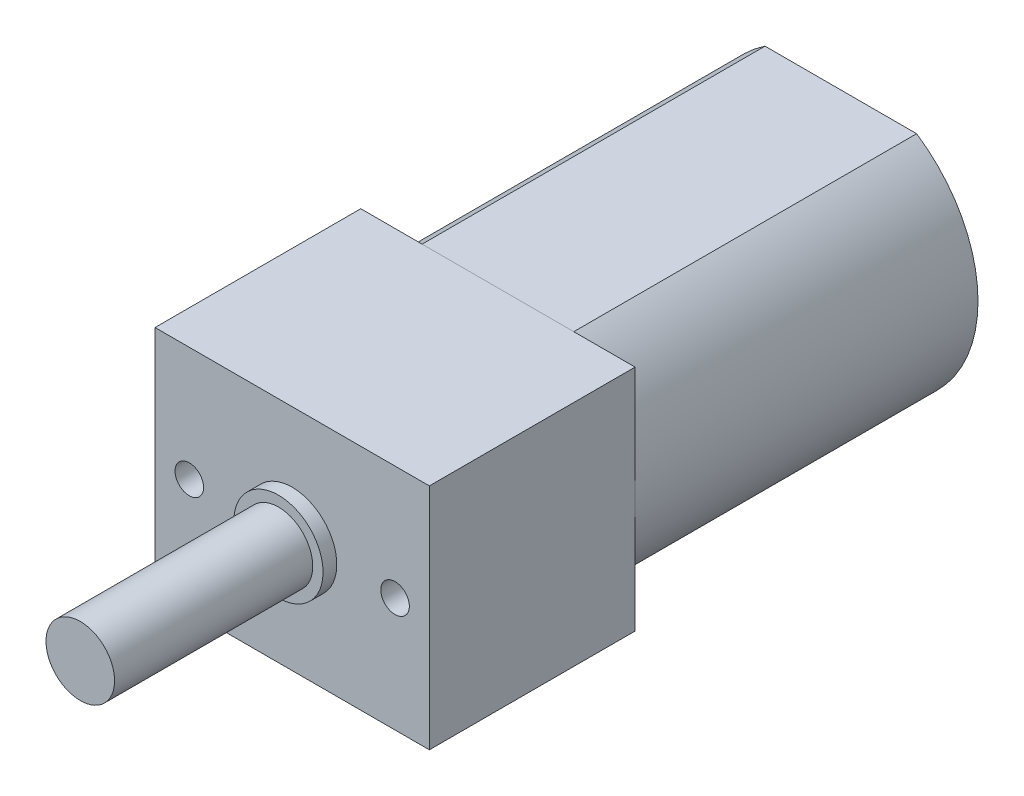
ISO-10303-21;
HEADER;
FILE_DESCRIPTION(('STEP AP214'),'2;1');
FILE_NAME('part.step','',(''),(''),'','','');
FILE_SCHEMA(('AUTOMOTIVE_DESIGN { 1 0 10303 214 1 1 1 1 }'));
ENDSEC;
DATA;
#1=APPLICATION_CONTEXT('core data for automotive mechanical design processes');
#2=APPLICATION_PROTOCOL_DEFINITION('international standard','automotive_design',2000,#1);
#3=PRODUCT_CONTEXT('',#1,'mechanical');
#4=PRODUCT('Part','Part','',(#3));
#5=PRODUCT_RELATED_PRODUCT_CATEGORY('part','',(#4));
#6=PRODUCT_DEFINITION_FORMATION('','',#4);
#7=PRODUCT_DEFINITION_CONTEXT('part definition',#1,'design');
#8=PRODUCT_DEFINITION('design','',#6,#7);
#9=PRODUCT_DEFINITION_SHAPE('','',#8);
#10=(LENGTH_UNIT() NAMED_UNIT(*) SI_UNIT(.MILLI.,.METRE.));
#11=(NAMED_UNIT(*) PLANE_ANGLE_UNIT() SI_UNIT($,.RADIAN.));
#12=(NAMED_UNIT(*) SI_UNIT($,.STERADIAN.) SOLID_ANGLE_UNIT());
#13=UNCERTAINTY_MEASURE_WITH_UNIT(LENGTH_MEASURE(1.E-05),#10,'distance_accuracy_value','');
#14=(GEOMETRIC_REPRESENTATION_CONTEXT(3) GLOBAL_UNCERTAINTY_ASSIGNED_CONTEXT((#13)) GLOBAL_UNIT_ASSIGNED_CONTEXT((#10,
#11,#12)) REPRESENTATION_CONTEXT('',''));
#15=CARTESIAN_POINT('',(0.,0.,0.));
#16=DIRECTION('',(0.,0.,1.));
#17=DIRECTION('',(1.,0.,0.));
#18=AXIS2_PLACEMENT_3D('',#15,#16,#17);
#19=CARTESIAN_POINT('',(0.,0.,-17.));
#20=DIRECTION('',(0.,0.,1.));
#21=DIRECTION('',(1.,0.,0.));
#22=AXIS2_PLACEMENT_3D('',#19,#20,#21);
#23=CYLINDRICAL_SURFACE('',#22,2.5);
#24=CARTESIAN_POINT('',(0.,0.,-17.));
#25=DIRECTION('',(0.,0.,-1.));
#26=DIRECTION('',(-1.,0.,0.));
#27=AXIS2_PLACEMENT_3D('',#24,#25,#26);
#28=CIRCLE('',#27,2.5);
#29=CARTESIAN_POINT('',(-2.5,0.,-17.));
#30=VERTEX_POINT('',#29);
#31=EDGE_CURVE('E11',#30,#30,#28,.T.);
#32=ORIENTED_EDGE('',*,*,#31,.F.);
#33=EDGE_LOOP('',(#32));
#34=FACE_BOUND('',#33,.T.);
#35=CARTESIAN_POINT('',(0.,0.,-15.));
#36=DIRECTION('',(0.,0.,-1.));
#37=DIRECTION('',(-1.,0.,0.));
#38=AXIS2_PLACEMENT_3D('',#35,#36,#37);
#39=CIRCLE('',#38,2.5);
#40=CARTESIAN_POINT('',(-2.5,0.,-15.));
#41=VERTEX_POINT('',#40);
#42=EDGE_CURVE('E52',#41,#41,#39,.T.);
#43=ORIENTED_EDGE('',*,*,#42,.T.);
#44=EDGE_LOOP('',(#43));
#45=FACE_BOUND('',#44,.T.);
#46=ADVANCED_FACE('F49',(#34,#45),#23,.T.);
#47=CARTESIAN_POINT('',(0.,0.,-17.));
#48=DIRECTION('',(0.,0.,-1.));
#49=DIRECTION('',(-1.,0.,0.));
#50=AXIS2_PLACEMENT_3D('',#47,#48,#49);
#51=PLANE('',#50);
#52=ORIENTED_EDGE('',*,*,#31,.T.);
#53=EDGE_LOOP('',(#52));
#54=FACE_BOUND('',#53,.T.);
#55=ADVANCED_FACE('F64',(#54),#51,.T.);
#56=CARTESIAN_POINT('',(0.,0.,-15.));
#57=DIRECTION('',(0.,0.,-1.));
#58=DIRECTION('',(-1.,0.,0.));
#59=AXIS2_PLACEMENT_3D('',#56,#57,#58);
#60=PLANE('',#59);
#61=ORIENTED_EDGE('',*,*,#42,.F.);
#62=EDGE_LOOP('',(#61));
#63=FACE_BOUND('',#62,.T.);
#64=ADVANCED_FACE('F62',(#63),#60,.F.);
#65=CLOSED_SHELL('',(#46,#55,#64));
#66=MANIFOLD_SOLID_BREP('B2',#65);
#67=CARTESIAN_POINT('',(0.,0.,-15.));
#68=DIRECTION('',(0.,0.,1.));
#69=DIRECTION('',(1.,0.,0.));
#70=AXIS2_PLACEMENT_3D('',#67,#68,#69);
#71=CYLINDRICAL_SURFACE('',#70,6.);
#72=CARTESIAN_POINT('',(0.,0.,0.));
#73=DIRECTION('',(0.,0.,-1.));
#74=DIRECTION('',(-1.,0.,0.));
#75=AXIS2_PLACEMENT_3D('',#72,#73,#74);
#76=CIRCLE('',#75,6.);
#77=CARTESIAN_POINT('',(3.31662479035539,5.,0.));
#78=VERTEX_POINT('',#77);
#79=CARTESIAN_POINT('',(3.31662479035539,-5.,0.));
#80=VERTEX_POINT('',#79);
#81=EDGE_CURVE('E161',#78,#80,#76,.T.);
#82=ORIENTED_EDGE('',*,*,#81,.T.);
#83=DIRECTION('',(0.,0.,1.));
#84=VECTOR('',#83,1.);
#85=CARTESIAN_POINT('',(3.31662479035539,-5.,-15.));
#86=LINE('',#85,#84);
#87=CARTESIAN_POINT('',(3.31662479035539,-5.,-15.));
#88=VERTEX_POINT('',#87);
#89=EDGE_CURVE('E47',#88,#80,#86,.T.);
#90=ORIENTED_EDGE('',*,*,#89,.F.);
#91=CARTESIAN_POINT('',(0.,0.,-15.));
#92=DIRECTION('',(0.,0.,-1.));
#93=DIRECTION('',(-1.,0.,0.));
#94=AXIS2_PLACEMENT_3D('',#91,#92,#93);
#95=CIRCLE('',#94,6.);
#96=CARTESIAN_POINT('',(3.31662479035539,5.,-15.));
#97=VERTEX_POINT('',#96);
#98=EDGE_CURVE('E149',#97,#88,#95,.T.);
#99=ORIENTED_EDGE('',*,*,#98,.F.);
#100=DIRECTION('',(0.,0.,1.));
#101=VECTOR('',#100,1.);
#102=CARTESIAN_POINT('',(3.31662479035539,5.,-15.));
#103=LINE('',#102,#101);
#104=EDGE_CURVE('E157',#97,#78,#103,.T.);
#105=ORIENTED_EDGE('',*,*,#104,.T.);
#106=EDGE_LOOP('',(#82,#90,#99,#105));
#107=FACE_BOUND('',#106,.T.);
#108=ADVANCED_FACE('F98',(#107),#71,.T.);
#109=CARTESIAN_POINT('',(3.31662479035539,-5.,-15.));
#110=DIRECTION('',(0.,1.,0.));
#111=DIRECTION('',(0.,0.,1.));
#112=AXIS2_PLACEMENT_3D('',#109,#110,#111);
#113=PLANE('',#112);
#114=DIRECTION('',(-1.,0.,0.));
#115=VECTOR('',#114,1.);
#116=CARTESIAN_POINT('',(3.31662479035539,-5.,0.));
#117=LINE('',#116,#115);
#118=CARTESIAN_POINT('',(-3.31662479035539,-5.,0.));
#119=VERTEX_POINT('',#118);
#120=EDGE_CURVE('E153',#80,#119,#117,.T.);
#121=ORIENTED_EDGE('',*,*,#120,.T.);
#122=DIRECTION('',(0.,0.,1.));
#123=VECTOR('',#122,1.);
#124=CARTESIAN_POINT('',(-3.31662479035539,-5.,-15.));
#125=LINE('',#124,#123);
#126=CARTESIAN_POINT('',(-3.31662479035539,-5.,-15.));
#127=VERTEX_POINT('',#126);
#128=EDGE_CURVE('E106',#127,#119,#125,.T.);
#129=ORIENTED_EDGE('',*,*,#128,.F.);
#130=DIRECTION('',(-1.,0.,0.));
#131=VECTOR('',#130,1.);
#132=CARTESIAN_POINT('',(3.31662479035539,-5.,-15.));
#133=LINE('',#132,#131);
#134=EDGE_CURVE('E144',#88,#127,#133,.T.);
#135=ORIENTED_EDGE('',*,*,#134,.F.);
#136=ORIENTED_EDGE('',*,*,#89,.T.);
#137=EDGE_LOOP('',(#121,#129,#135,#136));
#138=FACE_BOUND('',#137,.T.);
#139=ADVANCED_FACE('F152',(#138),#113,.F.);
#140=CARTESIAN_POINT('',(0.,0.,-15.));
#141=DIRECTION('',(0.,0.,1.));
#142=DIRECTION('',(1.,0.,0.));
#143=AXIS2_PLACEMENT_3D('',#140,#141,#142);
#144=CYLINDRICAL_SURFACE('',#143,6.);
#145=CARTESIAN_POINT('',(0.,0.,0.));
#146=DIRECTION('',(0.,0.,-1.));
#147=DIRECTION('',(-1.,0.,0.));
#148=AXIS2_PLACEMENT_3D('',#145,#146,#147);
#149=CIRCLE('',#148,6.);
#150=CARTESIAN_POINT('',(-3.31662479035539,5.,0.));
#151=VERTEX_POINT('',#150);
#152=EDGE_CURVE('E131',#119,#151,#149,.T.);
#153=ORIENTED_EDGE('',*,*,#152,.T.);
#154=DIRECTION('',(0.,0.,1.));
#155=VECTOR('',#154,1.);
#156=CARTESIAN_POINT('',(-3.31662479035539,5.,-15.));
#157=LINE('',#156,#155);
#158=CARTESIAN_POINT('',(-3.31662479035539,5.,-15.));
#159=VERTEX_POINT('',#158);
#160=EDGE_CURVE('E154',#159,#151,#157,.T.);
#161=ORIENTED_EDGE('',*,*,#160,.F.);
#162=CARTESIAN_POINT('',(0.,0.,-15.));
#163=DIRECTION('',(0.,0.,-1.));
#164=DIRECTION('',(-1.,0.,0.));
#165=AXIS2_PLACEMENT_3D('',#162,#163,#164);
#166=CIRCLE('',#165,6.);
#167=EDGE_CURVE('E147',#127,#159,#166,.T.);
#168=ORIENTED_EDGE('',*,*,#167,.F.);
#169=ORIENTED_EDGE('',*,*,#128,.T.);
#170=EDGE_LOOP('',(#153,#161,#168,#169));
#171=FACE_BOUND('',#170,.T.);
#172=ADVANCED_FACE('F155',(#171),#144,.T.);
#173=CARTESIAN_POINT('',(3.31662479035539,5.,-15.));
#174=DIRECTION('',(0.,-1.,0.));
#175=DIRECTION('',(0.,0.,-1.));
#176=AXIS2_PLACEMENT_3D('',#173,#174,#175);
#177=PLANE('',#176);
#178=DIRECTION('',(1.,0.,0.));
#179=VECTOR('',#178,1.);
#180=CARTESIAN_POINT('',(3.31662479035539,5.,0.));
#181=LINE('',#180,#179);
#182=EDGE_CURVE('E137',#151,#78,#181,.T.);
#183=ORIENTED_EDGE('',*,*,#182,.T.);
#184=ORIENTED_EDGE('',*,*,#104,.F.);
#185=DIRECTION('',(1.,0.,0.));
#186=VECTOR('',#185,1.);
#187=CARTESIAN_POINT('',(3.31662479035539,5.,-15.));
#188=LINE('',#187,#186);
#189=EDGE_CURVE('E114',#159,#97,#188,.T.);
#190=ORIENTED_EDGE('',*,*,#189,.F.);
#191=ORIENTED_EDGE('',*,*,#160,.T.);
#192=EDGE_LOOP('',(#183,#184,#190,#191));
#193=FACE_BOUND('',#192,.T.);
#194=ADVANCED_FACE('F168',(#193),#177,.F.);
#195=CARTESIAN_POINT('',(0.,0.,-15.));
#196=DIRECTION('',(0.,0.,-1.));
#197=DIRECTION('',(-1.,0.,0.));
#198=AXIS2_PLACEMENT_3D('',#195,#196,#197);
#199=PLANE('',#198);
#200=ORIENTED_EDGE('',*,*,#98,.T.);
#201=ORIENTED_EDGE('',*,*,#134,.T.);
#202=ORIENTED_EDGE('',*,*,#167,.T.);
#203=ORIENTED_EDGE('',*,*,#189,.T.);
#204=EDGE_LOOP('',(#200,#201,#202,#203));
#205=FACE_BOUND('',#204,.T.);
#206=ADVANCED_FACE('F145',(#205),#199,.T.);
#207=CARTESIAN_POINT('',(0.,0.,0.));
#208=DIRECTION('',(0.,0.,-1.));
#209=DIRECTION('',(-1.,0.,0.));
#210=AXIS2_PLACEMENT_3D('',#207,#208,#209);
#211=PLANE('',#210);
#212=ORIENTED_EDGE('',*,*,#81,.F.);
#213=ORIENTED_EDGE('',*,*,#182,.F.);
#214=ORIENTED_EDGE('',*,*,#152,.F.);
#215=ORIENTED_EDGE('',*,*,#120,.F.);
#216=EDGE_LOOP('',(#212,#213,#214,#215));
#217=FACE_BOUND('',#216,.T.);
#218=ADVANCED_FACE('F171',(#217),#211,.F.);
#219=CLOSED_SHELL('',(#108,#139,#172,#194,#206,#218));
#220=MANIFOLD_SOLID_BREP('B6',#219);
#221=CARTESIAN_POINT('',(6.,-5.,9.));
#222=DIRECTION('',(-1.,0.,0.));
#223=DIRECTION('',(0.,0.,1.));
#224=AXIS2_PLACEMENT_3D('',#221,#222,#223);
#225=PLANE('',#224);
#226=DIRECTION('',(0.,1.,0.));
#227=VECTOR('',#226,1.);
#228=CARTESIAN_POINT('',(6.,-5.,0.));
#229=LINE('',#228,#227);
#230=CARTESIAN_POINT('',(6.,-5.,0.));
#231=VERTEX_POINT('',#230);
#232=CARTESIAN_POINT('',(6.,5.,0.));
#233=VERTEX_POINT('',#232);
#234=EDGE_CURVE('E310',#231,#233,#229,.T.);
#235=ORIENTED_EDGE('',*,*,#234,.T.);
#236=DIRECTION('',(0.,0.,-1.));
#237=VECTOR('',#236,1.);
#238=CARTESIAN_POINT('',(6.,5.,9.));
#239=LINE('',#238,#237);
#240=CARTESIAN_POINT('',(6.,5.,9.));
#241=VERTEX_POINT('',#240);
#242=EDGE_CURVE('E96',#241,#233,#239,.T.);
#243=ORIENTED_EDGE('',*,*,#242,.F.);
#244=DIRECTION('',(0.,1.,0.));
#245=VECTOR('',#244,1.);
#246=CARTESIAN_POINT('',(6.,-5.,9.));
#247=LINE('',#246,#245);
#248=CARTESIAN_POINT('',(6.,-5.,9.));
#249=VERTEX_POINT('',#248);
#250=EDGE_CURVE('E311',#249,#241,#247,.T.);
#251=ORIENTED_EDGE('',*,*,#250,.F.);
#252=DIRECTION('',(0.,0.,-1.));
#253=VECTOR('',#252,1.);
#254=CARTESIAN_POINT('',(6.,-5.,9.));
#255=LINE('',#254,#253);
#256=EDGE_CURVE('E317',#249,#231,#255,.T.);
#257=ORIENTED_EDGE('',*,*,#256,.T.);
#258=EDGE_LOOP('',(#235,#243,#251,#257));
#259=FACE_BOUND('',#258,.T.);
#260=ADVANCED_FACE('F223',(#259),#225,.F.);
#261=CARTESIAN_POINT('',(-6.,5.,9.));
#262=DIRECTION('',(0.,-1.,0.));
#263=DIRECTION('',(0.,0.,-1.));
#264=AXIS2_PLACEMENT_3D('',#261,#262,#263);
#265=PLANE('',#264);
#266=DIRECTION('',(-1.,0.,0.));
#267=VECTOR('',#266,1.);
#268=CARTESIAN_POINT('',(-6.,5.,0.));
#269=LINE('',#268,#267);
#270=CARTESIAN_POINT('',(-6.,5.,0.));
#271=VERTEX_POINT('',#270);
#272=EDGE_CURVE('E320',#233,#271,#269,.T.);
#273=ORIENTED_EDGE('',*,*,#272,.T.);
#274=DIRECTION('',(0.,0.,-1.));
#275=VECTOR('',#274,1.);
#276=CARTESIAN_POINT('',(-6.,5.,9.));
#277=LINE('',#276,#275);
#278=CARTESIAN_POINT('',(-6.,5.,9.));
#279=VERTEX_POINT('',#278);
#280=EDGE_CURVE('E231',#279,#271,#277,.T.);
#281=ORIENTED_EDGE('',*,*,#280,.F.);
#282=DIRECTION('',(-1.,0.,0.));
#283=VECTOR('',#282,1.);
#284=CARTESIAN_POINT('',(-6.,5.,9.));
#285=LINE('',#284,#283);
#286=EDGE_CURVE('E270',#241,#279,#285,.T.);
#287=ORIENTED_EDGE('',*,*,#286,.F.);
#288=ORIENTED_EDGE('',*,*,#242,.T.);
#289=EDGE_LOOP('',(#273,#281,#287,#288));
#290=FACE_BOUND('',#289,.T.);
#291=ADVANCED_FACE('F344',(#290),#265,.F.);
#292=CARTESIAN_POINT('',(-6.,-5.,9.));
#293=DIRECTION('',(1.,0.,0.));
#294=DIRECTION('',(0.,0.,-1.));
#295=AXIS2_PLACEMENT_3D('',#292,#293,#294);
#296=PLANE('',#295);
#297=DIRECTION('',(0.,-1.,0.));
#298=VECTOR('',#297,1.);
#299=CARTESIAN_POINT('',(-6.,-5.,0.));
#300=LINE('',#299,#298);
#301=CARTESIAN_POINT('',(-6.,-5.,0.));
#302=VERTEX_POINT('',#301);
#303=EDGE_CURVE('E257',#271,#302,#300,.T.);
#304=ORIENTED_EDGE('',*,*,#303,.T.);
#305=DIRECTION('',(0.,0.,-1.));
#306=VECTOR('',#305,1.);
#307=CARTESIAN_POINT('',(-6.,-5.,9.));
#308=LINE('',#307,#306);
#309=CARTESIAN_POINT('',(-6.,-5.,9.));
#310=VERTEX_POINT('',#309);
#311=EDGE_CURVE('E325',#310,#302,#308,.T.);
#312=ORIENTED_EDGE('',*,*,#311,.F.);
#313=DIRECTION('',(0.,-1.,0.));
#314=VECTOR('',#313,1.);
#315=CARTESIAN_POINT('',(-6.,-5.,9.));
#316=LINE('',#315,#314);
#317=EDGE_CURVE('E314',#279,#310,#316,.T.);
#318=ORIENTED_EDGE('',*,*,#317,.F.);
#319=ORIENTED_EDGE('',*,*,#280,.T.);
#320=EDGE_LOOP('',(#304,#312,#318,#319));
#321=FACE_BOUND('',#320,.T.);
#322=ADVANCED_FACE('F327',(#321),#296,.F.);
#323=CARTESIAN_POINT('',(-6.,-5.,9.));
#324=DIRECTION('',(0.,1.,0.));
#325=DIRECTION('',(0.,0.,1.));
#326=AXIS2_PLACEMENT_3D('',#323,#324,#325);
#327=PLANE('',#326);
#328=DIRECTION('',(1.,0.,0.));
#329=VECTOR('',#328,1.);
#330=CARTESIAN_POINT('',(-6.,-5.,0.));
#331=LINE('',#330,#329);
#332=EDGE_CURVE('E263',#302,#231,#331,.T.);
#333=ORIENTED_EDGE('',*,*,#332,.T.);
#334=ORIENTED_EDGE('',*,*,#256,.F.);
#335=DIRECTION('',(1.,0.,0.));
#336=VECTOR('',#335,1.);
#337=CARTESIAN_POINT('',(-6.,-5.,9.));
#338=LINE('',#337,#336);
#339=EDGE_CURVE('E239',#310,#249,#338,.T.);
#340=ORIENTED_EDGE('',*,*,#339,.F.);
#341=ORIENTED_EDGE('',*,*,#311,.T.);
#342=EDGE_LOOP('',(#333,#334,#340,#341));
#343=FACE_BOUND('',#342,.T.);
#344=ADVANCED_FACE('F334',(#343),#327,.F.);
#345=CARTESIAN_POINT('',(0.,0.,9.));
#346=DIRECTION('',(0.,0.,-1.));
#347=DIRECTION('',(-1.,0.,0.));
#348=AXIS2_PLACEMENT_3D('',#345,#346,#347);
#349=PLANE('',#348);
#350=CARTESIAN_POINT('',(-4.5,0.,9.));
#351=DIRECTION('',(0.,0.,1.));
#352=DIRECTION('',(1.,0.,0.));
#353=AXIS2_PLACEMENT_3D('',#350,#351,#352);
#354=CIRCLE('',#353,0.624999999999999);
#355=CARTESIAN_POINT('',(-3.875,0.,9.));
#356=VERTEX_POINT('',#355);
#357=EDGE_CURVE('E288',#356,#356,#354,.T.);
#358=ORIENTED_EDGE('',*,*,#357,.F.);
#359=EDGE_LOOP('',(#358));
#360=FACE_BOUND('',#359,.T.);
#361=CARTESIAN_POINT('',(4.5,0.,9.));
#362=DIRECTION('',(0.,0.,1.));
#363=DIRECTION('',(1.,0.,0.));
#364=AXIS2_PLACEMENT_3D('',#361,#362,#363);
#365=CIRCLE('',#364,0.624999999999999);
#366=CARTESIAN_POINT('',(5.125,0.,9.));
#367=VERTEX_POINT('',#366);
#368=EDGE_CURVE('E287',#367,#367,#365,.T.);
#369=ORIENTED_EDGE('',*,*,#368,.F.);
#370=EDGE_LOOP('',(#369));
#371=FACE_BOUND('',#370,.T.);
#372=CARTESIAN_POINT('',(0.,0.,9.));
#373=DIRECTION('',(0.,0.,-1.));
#374=DIRECTION('',(0.,1.,0.));
#375=AXIS2_PLACEMENT_3D('',#372,#373,#374);
#376=CIRCLE('',#375,1.95);
#377=CARTESIAN_POINT('',(0.,1.95,9.));
#378=VERTEX_POINT('',#377);
#379=EDGE_CURVE('E307',#378,#378,#376,.T.);
#380=ORIENTED_EDGE('',*,*,#379,.T.);
#381=EDGE_LOOP('',(#380));
#382=FACE_BOUND('',#381,.T.);
#383=ORIENTED_EDGE('',*,*,#250,.T.);
#384=ORIENTED_EDGE('',*,*,#286,.T.);
#385=ORIENTED_EDGE('',*,*,#317,.T.);
#386=ORIENTED_EDGE('',*,*,#339,.T.);
#387=EDGE_LOOP('',(#383,#384,#385,#386));
#388=FACE_BOUND('',#387,.T.);
#389=ADVANCED_FACE('F336',(#360,#371,#382,#388),#349,.F.);
#390=CARTESIAN_POINT('',(0.,0.,0.));
#391=DIRECTION('',(0.,0.,-1.));
#392=DIRECTION('',(-1.,0.,0.));
#393=AXIS2_PLACEMENT_3D('',#390,#391,#392);
#394=PLANE('',#393);
#395=ORIENTED_EDGE('',*,*,#234,.F.);
#396=ORIENTED_EDGE('',*,*,#332,.F.);
#397=ORIENTED_EDGE('',*,*,#303,.F.);
#398=ORIENTED_EDGE('',*,*,#272,.F.);
#399=EDGE_LOOP('',(#395,#396,#397,#398));
#400=FACE_BOUND('',#399,.T.);
#401=ADVANCED_FACE('F330',(#400),#394,.T.);
#402=CARTESIAN_POINT('',(0.,0.,9.));
#403=DIRECTION('',(0.,0.,-1.));
#404=DIRECTION('',(0.,1.,0.));
#405=AXIS2_PLACEMENT_3D('',#402,#403,#404);
#406=CYLINDRICAL_SURFACE('',#405,1.95);
#407=CARTESIAN_POINT('',(0.,0.,9.6));
#408=DIRECTION('',(0.,0.,-1.));
#409=DIRECTION('',(0.,1.,0.));
#410=AXIS2_PLACEMENT_3D('',#407,#408,#409);
#411=CIRCLE('',#410,1.95);
#412=CARTESIAN_POINT('',(0.,1.95,9.6));
#413=VERTEX_POINT('',#412);
#414=EDGE_CURVE('E304',#413,#413,#411,.T.);
#415=ORIENTED_EDGE('',*,*,#414,.T.);
#416=EDGE_LOOP('',(#415));
#417=FACE_BOUND('',#416,.T.);
#418=ORIENTED_EDGE('',*,*,#379,.F.);
#419=EDGE_LOOP('',(#418));
#420=FACE_BOUND('',#419,.T.);
#421=ADVANCED_FACE('F371',(#417,#420),#406,.T.);
#422=CARTESIAN_POINT('',(0.,1.95,9.6));
#423=DIRECTION('',(0.,0.,1.));
#424=DIRECTION('',(0.,-1.,0.));
#425=AXIS2_PLACEMENT_3D('',#422,#423,#424);
#426=PLANE('',#425);
#427=CARTESIAN_POINT('',(0.,0.,9.6));
#428=DIRECTION('',(0.,0.,-1.));
#429=DIRECTION('',(0.,1.,0.));
#430=AXIS2_PLACEMENT_3D('',#427,#428,#429);
#431=CIRCLE('',#430,1.5);
#432=CARTESIAN_POINT('',(0.,1.5,9.6));
#433=VERTEX_POINT('',#432);
#434=EDGE_CURVE('E301',#433,#433,#431,.T.);
#435=ORIENTED_EDGE('',*,*,#434,.T.);
#436=EDGE_LOOP('',(#435));
#437=FACE_BOUND('',#436,.T.);
#438=ORIENTED_EDGE('',*,*,#414,.F.);
#439=EDGE_LOOP('',(#438));
#440=FACE_BOUND('',#439,.T.);
#441=ADVANCED_FACE('F380',(#437,#440),#426,.T.);
#442=CARTESIAN_POINT('',(0.,0.,9.));
#443=DIRECTION('',(0.,0.,-1.));
#444=DIRECTION('',(0.,1.,0.));
#445=AXIS2_PLACEMENT_3D('',#442,#443,#444);
#446=CYLINDRICAL_SURFACE('',#445,1.5);
#447=CARTESIAN_POINT('',(0.,0.,18.27));
#448=DIRECTION('',(0.,0.,-1.));
#449=DIRECTION('',(0.,1.,0.));
#450=AXIS2_PLACEMENT_3D('',#447,#448,#449);
#451=CIRCLE('',#450,1.5);
#452=CARTESIAN_POINT('',(0.,1.5,18.27));
#453=VERTEX_POINT('',#452);
#454=EDGE_CURVE('E298',#453,#453,#451,.T.);
#455=ORIENTED_EDGE('',*,*,#454,.T.);
#456=EDGE_LOOP('',(#455));
#457=FACE_BOUND('',#456,.T.);
#458=ORIENTED_EDGE('',*,*,#434,.F.);
#459=EDGE_LOOP('',(#458));
#460=FACE_BOUND('',#459,.T.);
#461=ADVANCED_FACE('F392',(#457,#460),#446,.T.);
#462=CARTESIAN_POINT('',(0.,1.5,18.27));
#463=DIRECTION('',(0.,0.,1.));
#464=DIRECTION('',(0.,-1.,0.));
#465=AXIS2_PLACEMENT_3D('',#462,#463,#464);
#466=PLANE('',#465);
#467=ORIENTED_EDGE('',*,*,#454,.F.);
#468=EDGE_LOOP('',(#467));
#469=FACE_BOUND('',#468,.T.);
#470=ADVANCED_FACE('F402',(#469),#466,.T.);
#471=CARTESIAN_POINT('',(4.5,0.,6.95));
#472=DIRECTION('',(0.,0.,1.));
#473=DIRECTION('',(1.,0.,0.));
#474=AXIS2_PLACEMENT_3D('',#471,#472,#473);
#475=CONICAL_SURFACE('',#474,0.624999999999999,1.02974425867665);
#476=CARTESIAN_POINT('',(4.5,0.,6.57446211310777));
#477=VERTEX_POINT('',#476);
#478=VERTEX_LOOP('',#477);
#479=FACE_BOUND('',#478,.T.);
#480=CARTESIAN_POINT('',(4.5,0.,6.95));
#481=DIRECTION('',(0.,0.,1.));
#482=DIRECTION('',(1.,0.,0.));
#483=AXIS2_PLACEMENT_3D('',#480,#481,#482);
#484=CIRCLE('',#483,0.624999999999999);
#485=CARTESIAN_POINT('',(5.125,0.,6.95));
#486=VERTEX_POINT('',#485);
#487=EDGE_CURVE('E291',#486,#486,#484,.T.);
#488=ORIENTED_EDGE('',*,*,#487,.T.);
#489=EDGE_LOOP('',(#488));
#490=FACE_BOUND('',#489,.T.);
#491=ADVANCED_FACE('F412',(#479,#490),#475,.F.);
#492=CARTESIAN_POINT('',(4.5,0.,9.));
#493=DIRECTION('',(0.,0.,1.));
#494=DIRECTION('',(1.,0.,0.));
#495=AXIS2_PLACEMENT_3D('',#492,#493,#494);
#496=CYLINDRICAL_SURFACE('',#495,0.624999999999999);
#497=ORIENTED_EDGE('',*,*,#487,.F.);
#498=EDGE_LOOP('',(#497));
#499=FACE_BOUND('',#498,.T.);
#500=ORIENTED_EDGE('',*,*,#368,.T.);
#501=EDGE_LOOP('',(#500));
#502=FACE_BOUND('',#501,.T.);
#503=ADVANCED_FACE('F281',(#499,#502),#496,.F.);
#504=CARTESIAN_POINT('',(-4.5,0.,6.95));
#505=DIRECTION('',(0.,0.,1.));
#506=DIRECTION('',(1.,0.,0.));
#507=AXIS2_PLACEMENT_3D('',#504,#505,#506);
#508=CONICAL_SURFACE('',#507,0.624999999999999,1.02974425867665);
#509=CARTESIAN_POINT('',(-4.5,0.,6.57446211310777));
#510=VERTEX_POINT('',#509);
#511=VERTEX_LOOP('',#510);
#512=FACE_BOUND('',#511,.T.);
#513=CARTESIAN_POINT('',(-4.5,0.,6.95));
#514=DIRECTION('',(0.,0.,1.));
#515=DIRECTION('',(1.,0.,0.));
#516=AXIS2_PLACEMENT_3D('',#513,#514,#515);
#517=CIRCLE('',#516,0.624999999999999);
#518=CARTESIAN_POINT('',(-3.875,0.,6.95));
#519=VERTEX_POINT('',#518);
#520=EDGE_CURVE('E285',#519,#519,#517,.T.);
#521=ORIENTED_EDGE('',*,*,#520,.T.);
#522=EDGE_LOOP('',(#521));
#523=FACE_BOUND('',#522,.T.);
#524=ADVANCED_FACE('F277',(#512,#523),#508,.F.);
#525=CARTESIAN_POINT('',(-4.5,0.,9.));
#526=DIRECTION('',(0.,0.,1.));
#527=DIRECTION('',(1.,0.,0.));
#528=AXIS2_PLACEMENT_3D('',#525,#526,#527);
#529=CYLINDRICAL_SURFACE('',#528,0.624999999999999);
#530=ORIENTED_EDGE('',*,*,#520,.F.);
#531=EDGE_LOOP('',(#530));
#532=FACE_BOUND('',#531,.T.);
#533=ORIENTED_EDGE('',*,*,#357,.T.);
#534=EDGE_LOOP('',(#533));
#535=FACE_BOUND('',#534,.T.);
#536=ADVANCED_FACE('F280',(#532,#535),#529,.F.);
#537=CLOSED_SHELL('',(#260,#291,#322,#344,#389,#401,#421,#441,#461,#470,#491,#503,#524,#536));
#538=MANIFOLD_SOLID_BREP('B41',#537);
#539=ADVANCED_BREP_SHAPE_REPRESENTATION('',(#18,#66,#220,#538),#14);
#540=SHAPE_DEFINITION_REPRESENTATION(#9,#539);
ENDSEC;
END-ISO-10303-21;
